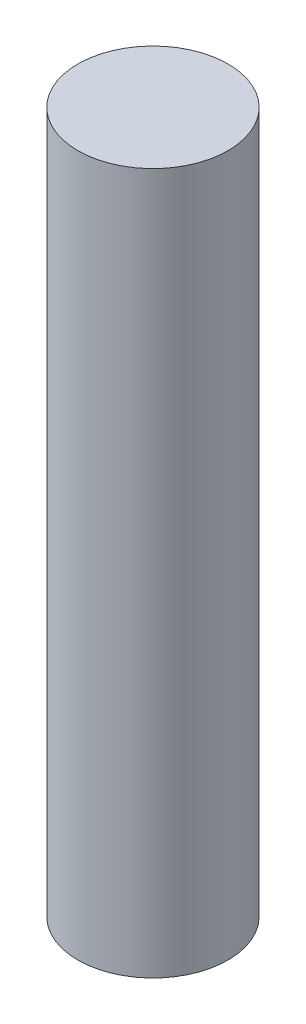
ISO-10303-21;
HEADER;
FILE_DESCRIPTION(('STEP AP214'),'2;1');
FILE_NAME('part.step','',(''),(''),'','','');
FILE_SCHEMA(('AUTOMOTIVE_DESIGN { 1 0 10303 214 1 1 1 1 }'));
ENDSEC;
DATA;
#1=APPLICATION_CONTEXT('core data for automotive mechanical design processes');
#2=APPLICATION_PROTOCOL_DEFINITION('international standard','automotive_design',2000,#1);
#3=PRODUCT_CONTEXT('',#1,'mechanical');
#4=PRODUCT('Part','Part','',(#3));
#5=PRODUCT_RELATED_PRODUCT_CATEGORY('part','',(#4));
#6=PRODUCT_DEFINITION_FORMATION('','',#4);
#7=PRODUCT_DEFINITION_CONTEXT('part definition',#1,'design');
#8=PRODUCT_DEFINITION('design','',#6,#7);
#9=PRODUCT_DEFINITION_SHAPE('','',#8);
#10=(LENGTH_UNIT() NAMED_UNIT(*) SI_UNIT(.MILLI.,.METRE.));
#11=(NAMED_UNIT(*) PLANE_ANGLE_UNIT() SI_UNIT($,.RADIAN.));
#12=(NAMED_UNIT(*) SI_UNIT($,.STERADIAN.) SOLID_ANGLE_UNIT());
#13=UNCERTAINTY_MEASURE_WITH_UNIT(LENGTH_MEASURE(1.E-05),#10,'distance_accuracy_value','');
#14=(GEOMETRIC_REPRESENTATION_CONTEXT(3) GLOBAL_UNCERTAINTY_ASSIGNED_CONTEXT((#13)) GLOBAL_UNIT_ASSIGNED_CONTEXT((#10,
#11,#12)) REPRESENTATION_CONTEXT('',''));
#15=CARTESIAN_POINT('',(0.,0.,0.));
#16=DIRECTION('',(0.,0.,1.));
#17=DIRECTION('',(1.,0.,0.));
#18=AXIS2_PLACEMENT_3D('',#15,#16,#17);
#19=CARTESIAN_POINT('',(0.,88.9,0.));
#20=DIRECTION('',(0.,-1.,0.));
#21=DIRECTION('',(0.,0.,-1.));
#22=AXIS2_PLACEMENT_3D('',#19,#20,#21);
#23=CYLINDRICAL_SURFACE('',#22,9.525);
#24=CARTESIAN_POINT('',(0.,88.9,0.));
#25=DIRECTION('',(0.,1.,0.));
#26=DIRECTION('',(0.,0.,1.));
#27=AXIS2_PLACEMENT_3D('',#24,#25,#26);
#28=CIRCLE('',#27,9.525);
#29=CARTESIAN_POINT('',(0.,88.9,9.525));
#30=VERTEX_POINT('',#29);
#31=EDGE_CURVE('E10',#30,#30,#28,.T.);
#32=ORIENTED_EDGE('',*,*,#31,.F.);
#33=EDGE_LOOP('',(#32));
#34=FACE_BOUND('',#33,.T.);
#35=CARTESIAN_POINT('',(0.,0.,0.));
#36=DIRECTION('',(0.,1.,0.));
#37=DIRECTION('',(0.,0.,1.));
#38=AXIS2_PLACEMENT_3D('',#35,#36,#37);
#39=CIRCLE('',#38,9.525);
#40=CARTESIAN_POINT('',(0.,0.,9.525));
#41=VERTEX_POINT('',#40);
#42=EDGE_CURVE('E18',#41,#41,#39,.T.);
#43=ORIENTED_EDGE('',*,*,#42,.T.);
#44=EDGE_LOOP('',(#43));
#45=FACE_BOUND('',#44,.T.);
#46=ADVANCED_FACE('F15',(#34,#45),#23,.T.);
#47=CARTESIAN_POINT('',(0.,88.9,0.));
#48=DIRECTION('',(0.,1.,0.));
#49=DIRECTION('',(0.,0.,1.));
#50=AXIS2_PLACEMENT_3D('',#47,#48,#49);
#51=PLANE('',#50);
#52=ORIENTED_EDGE('',*,*,#31,.T.);
#53=EDGE_LOOP('',(#52));
#54=FACE_BOUND('',#53,.T.);
#55=ADVANCED_FACE('F30',(#54),#51,.T.);
#56=CARTESIAN_POINT('',(0.,0.,0.));
#57=DIRECTION('',(0.,1.,0.));
#58=DIRECTION('',(0.,0.,1.));
#59=AXIS2_PLACEMENT_3D('',#56,#57,#58);
#60=PLANE('',#59);
#61=ORIENTED_EDGE('',*,*,#42,.F.);
#62=EDGE_LOOP('',(#61));
#63=FACE_BOUND('',#62,.T.);
#64=ADVANCED_FACE('F28',(#63),#60,.F.);
#65=CLOSED_SHELL('',(#46,#55,#64));
#66=MANIFOLD_SOLID_BREP('B1',#65);
#67=ADVANCED_BREP_SHAPE_REPRESENTATION('',(#18,#66),#14);
#68=SHAPE_DEFINITION_REPRESENTATION(#9,#67);
ENDSEC;
END-ISO-10303-21;
